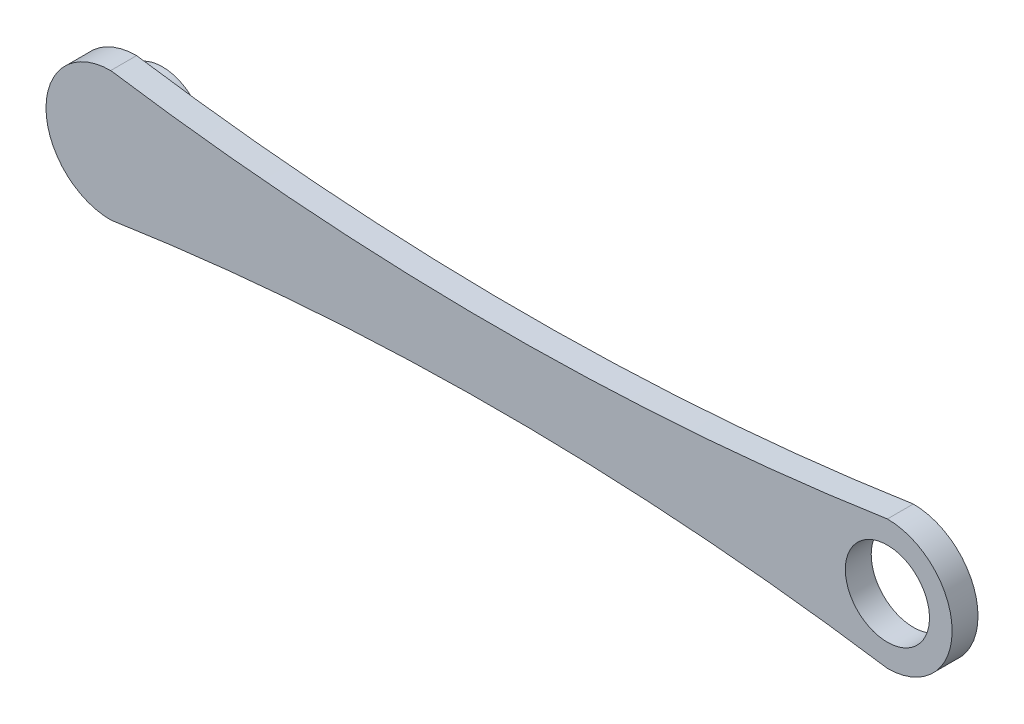
ISO-10303-21;
HEADER;
FILE_DESCRIPTION(('STEP AP214'),'2;1');
FILE_NAME('part.step','',(''),(''),'','','');
FILE_SCHEMA(('AUTOMOTIVE_DESIGN { 1 0 10303 214 1 1 1 1 }'));
ENDSEC;
DATA;
#1=APPLICATION_CONTEXT('core data for automotive mechanical design processes');
#2=APPLICATION_PROTOCOL_DEFINITION('international standard','automotive_design',2000,#1);
#3=PRODUCT_CONTEXT('',#1,'mechanical');
#4=PRODUCT('Part','Part','',(#3));
#5=PRODUCT_RELATED_PRODUCT_CATEGORY('part','',(#4));
#6=PRODUCT_DEFINITION_FORMATION('','',#4);
#7=PRODUCT_DEFINITION_CONTEXT('part definition',#1,'design');
#8=PRODUCT_DEFINITION('design','',#6,#7);
#9=PRODUCT_DEFINITION_SHAPE('','',#8);
#10=(LENGTH_UNIT() NAMED_UNIT(*) SI_UNIT(.MILLI.,.METRE.));
#11=(NAMED_UNIT(*) PLANE_ANGLE_UNIT() SI_UNIT($,.RADIAN.));
#12=(NAMED_UNIT(*) SI_UNIT($,.STERADIAN.) SOLID_ANGLE_UNIT());
#13=UNCERTAINTY_MEASURE_WITH_UNIT(LENGTH_MEASURE(1.E-05),#10,'distance_accuracy_value','');
#14=(GEOMETRIC_REPRESENTATION_CONTEXT(3) GLOBAL_UNCERTAINTY_ASSIGNED_CONTEXT((#13)) GLOBAL_UNIT_ASSIGNED_CONTEXT((#10,
#11,#12)) REPRESENTATION_CONTEXT('',''));
#15=CARTESIAN_POINT('',(0.,0.,0.));
#16=DIRECTION('',(0.,0.,1.));
#17=DIRECTION('',(1.,0.,0.));
#18=AXIS2_PLACEMENT_3D('',#15,#16,#17);
#19=CARTESIAN_POINT('',(1.76308690024151E-13,1013.68599666426,10.));
#20=DIRECTION('',(0.,0.,-1.));
#21=DIRECTION('',(-1.,0.,0.));
#22=AXIS2_PLACEMENT_3D('',#19,#20,#21);
#23=CYLINDRICAL_SURFACE('',#22,1000.);
#24=CARTESIAN_POINT('',(1.76308690024151E-13,1013.68599666426,0.));
#25=DIRECTION('',(0.,0.,-1.));
#26=DIRECTION('',(1.,0.,0.));
#27=AXIS2_PLACEMENT_3D('',#24,#25,#26);
#28=CIRCLE('',#27,1000.);
#29=CARTESIAN_POINT('',(150.,25.,0.));
#30=VERTEX_POINT('',#29);
#31=CARTESIAN_POINT('',(-150.,25.,0.));
#32=VERTEX_POINT('',#31);
#33=EDGE_CURVE('E99',#30,#32,#28,.T.);
#34=ORIENTED_EDGE('',*,*,#33,.T.);
#35=DIRECTION('',(0.,0.,-1.));
#36=VECTOR('',#35,1.);
#37=CARTESIAN_POINT('',(-150.,25.,10.));
#38=LINE('',#37,#36);
#39=CARTESIAN_POINT('',(-150.,25.,10.));
#40=VERTEX_POINT('',#39);
#41=EDGE_CURVE('E41',#40,#32,#38,.T.);
#42=ORIENTED_EDGE('',*,*,#41,.F.);
#43=CARTESIAN_POINT('',(1.76308690024151E-13,1013.68599666426,10.));
#44=DIRECTION('',(0.,0.,-1.));
#45=DIRECTION('',(1.,0.,0.));
#46=AXIS2_PLACEMENT_3D('',#43,#44,#45);
#47=CIRCLE('',#46,1000.);
#48=CARTESIAN_POINT('',(150.,25.,10.));
#49=VERTEX_POINT('',#48);
#50=EDGE_CURVE('E85',#49,#40,#47,.T.);
#51=ORIENTED_EDGE('',*,*,#50,.F.);
#52=DIRECTION('',(0.,0.,-1.));
#53=VECTOR('',#52,1.);
#54=CARTESIAN_POINT('',(150.,25.,10.));
#55=LINE('',#54,#53);
#56=EDGE_CURVE('E95',#49,#30,#55,.T.);
#57=ORIENTED_EDGE('',*,*,#56,.T.);
#58=EDGE_LOOP('',(#34,#42,#51,#57));
#59=FACE_BOUND('',#58,.T.);
#60=ADVANCED_FACE('F33',(#59),#23,.F.);
#61=CARTESIAN_POINT('',(-150.,0.,10.));
#62=DIRECTION('',(0.,0.,-1.));
#63=DIRECTION('',(-1.,0.,0.));
#64=AXIS2_PLACEMENT_3D('',#61,#62,#63);
#65=CYLINDRICAL_SURFACE('',#64,25.);
#66=CARTESIAN_POINT('',(-150.,0.,0.));
#67=DIRECTION('',(0.,0.,1.));
#68=DIRECTION('',(1.,0.,0.));
#69=AXIS2_PLACEMENT_3D('',#66,#67,#68);
#70=CIRCLE('',#69,25.);
#71=CARTESIAN_POINT('',(-150.,-25.0000000000001,0.));
#72=VERTEX_POINT('',#71);
#73=EDGE_CURVE('E90',#32,#72,#70,.T.);
#74=ORIENTED_EDGE('',*,*,#73,.T.);
#75=DIRECTION('',(0.,0.,-1.));
#76=VECTOR('',#75,1.);
#77=CARTESIAN_POINT('',(-150.,-25.0000000000001,10.));
#78=LINE('',#77,#76);
#79=CARTESIAN_POINT('',(-150.,-25.0000000000001,10.));
#80=VERTEX_POINT('',#79);
#81=EDGE_CURVE('E88',#80,#72,#78,.T.);
#82=ORIENTED_EDGE('',*,*,#81,.F.);
#83=CARTESIAN_POINT('',(-150.,0.,10.));
#84=DIRECTION('',(0.,0.,1.));
#85=DIRECTION('',(1.,0.,0.));
#86=AXIS2_PLACEMENT_3D('',#83,#84,#85);
#87=CIRCLE('',#86,25.);
#88=EDGE_CURVE('E80',#40,#80,#87,.T.);
#89=ORIENTED_EDGE('',*,*,#88,.F.);
#90=ORIENTED_EDGE('',*,*,#41,.T.);
#91=EDGE_LOOP('',(#74,#82,#89,#90));
#92=FACE_BOUND('',#91,.T.);
#93=ADVANCED_FACE('F89',(#92),#65,.T.);
#94=CARTESIAN_POINT('',(1.76308690024151E-13,-1013.68599666426,10.));
#95=DIRECTION('',(0.,0.,-1.));
#96=DIRECTION('',(-1.,0.,0.));
#97=AXIS2_PLACEMENT_3D('',#94,#95,#96);
#98=CYLINDRICAL_SURFACE('',#97,1000.);
#99=CARTESIAN_POINT('',(1.76308690024151E-13,-1013.68599666426,0.));
#100=DIRECTION('',(0.,0.,-1.));
#101=DIRECTION('',(-1.,0.,0.));
#102=AXIS2_PLACEMENT_3D('',#99,#100,#101);
#103=CIRCLE('',#102,1000.);
#104=CARTESIAN_POINT('',(150.,-25.,0.));
#105=VERTEX_POINT('',#104);
#106=EDGE_CURVE('E66',#72,#105,#103,.T.);
#107=ORIENTED_EDGE('',*,*,#106,.T.);
#108=DIRECTION('',(0.,0.,-1.));
#109=VECTOR('',#108,1.);
#110=CARTESIAN_POINT('',(150.,-25.,10.));
#111=LINE('',#110,#109);
#112=CARTESIAN_POINT('',(150.,-25.,10.));
#113=VERTEX_POINT('',#112);
#114=EDGE_CURVE('E91',#113,#105,#111,.T.);
#115=ORIENTED_EDGE('',*,*,#114,.F.);
#116=CARTESIAN_POINT('',(1.76308690024151E-13,-1013.68599666426,10.));
#117=DIRECTION('',(0.,0.,-1.));
#118=DIRECTION('',(-1.,0.,0.));
#119=AXIS2_PLACEMENT_3D('',#116,#117,#118);
#120=CIRCLE('',#119,1000.);
#121=EDGE_CURVE('E83',#80,#113,#120,.T.);
#122=ORIENTED_EDGE('',*,*,#121,.F.);
#123=ORIENTED_EDGE('',*,*,#81,.T.);
#124=EDGE_LOOP('',(#107,#115,#122,#123));
#125=FACE_BOUND('',#124,.T.);
#126=ADVANCED_FACE('F93',(#125),#98,.F.);
#127=CARTESIAN_POINT('',(150.,0.,10.));
#128=DIRECTION('',(0.,0.,-1.));
#129=DIRECTION('',(-1.,0.,0.));
#130=AXIS2_PLACEMENT_3D('',#127,#128,#129);
#131=CYLINDRICAL_SURFACE('',#130,25.);
#132=CARTESIAN_POINT('',(150.,0.,0.));
#133=DIRECTION('',(0.,0.,1.));
#134=DIRECTION('',(1.,0.,0.));
#135=AXIS2_PLACEMENT_3D('',#132,#133,#134);
#136=CIRCLE('',#135,25.);
#137=EDGE_CURVE('E72',#105,#30,#136,.T.);
#138=ORIENTED_EDGE('',*,*,#137,.T.);
#139=ORIENTED_EDGE('',*,*,#56,.F.);
#140=CARTESIAN_POINT('',(150.,0.,10.));
#141=DIRECTION('',(0.,0.,1.));
#142=DIRECTION('',(1.,0.,0.));
#143=AXIS2_PLACEMENT_3D('',#140,#141,#142);
#144=CIRCLE('',#143,25.);
#145=EDGE_CURVE('E49',#113,#49,#144,.T.);
#146=ORIENTED_EDGE('',*,*,#145,.F.);
#147=ORIENTED_EDGE('',*,*,#114,.T.);
#148=EDGE_LOOP('',(#138,#139,#146,#147));
#149=FACE_BOUND('',#148,.T.);
#150=ADVANCED_FACE('F122',(#149),#131,.T.);
#151=CARTESIAN_POINT('',(75.0000000000002,506.84299833213,10.));
#152=DIRECTION('',(0.,0.,1.));
#153=DIRECTION('',(1.,0.,0.));
#154=AXIS2_PLACEMENT_3D('',#151,#152,#153);
#155=PLANE('',#154);
#156=CARTESIAN_POINT('',(150.,0.,10.));
#157=DIRECTION('',(0.,0.,1.));
#158=DIRECTION('',(-1.,0.,0.));
#159=AXIS2_PLACEMENT_3D('',#156,#157,#158);
#160=CIRCLE('',#159,16.25);
#161=CARTESIAN_POINT('',(133.75,0.,10.));
#162=VERTEX_POINT('',#161);
#163=EDGE_CURVE('E182',#162,#162,#160,.T.);
#164=ORIENTED_EDGE('',*,*,#163,.F.);
#165=EDGE_LOOP('',(#164));
#166=FACE_BOUND('',#165,.T.);
#167=ORIENTED_EDGE('',*,*,#50,.T.);
#168=ORIENTED_EDGE('',*,*,#88,.T.);
#169=ORIENTED_EDGE('',*,*,#121,.T.);
#170=ORIENTED_EDGE('',*,*,#145,.T.);
#171=EDGE_LOOP('',(#167,#168,#169,#170));
#172=FACE_BOUND('',#171,.T.);
#173=ADVANCED_FACE('F81',(#166,#172),#155,.T.);
#174=CARTESIAN_POINT('',(75.0000000000002,506.84299833213,0.));
#175=DIRECTION('',(0.,0.,1.));
#176=DIRECTION('',(1.,0.,0.));
#177=AXIS2_PLACEMENT_3D('',#174,#175,#176);
#178=PLANE('',#177);
#179=CARTESIAN_POINT('',(150.,0.,0.));
#180=DIRECTION('',(0.,0.,1.));
#181=DIRECTION('',(-1.,0.,0.));
#182=AXIS2_PLACEMENT_3D('',#179,#180,#181);
#183=CIRCLE('',#182,16.25);
#184=CARTESIAN_POINT('',(133.75,0.,0.));
#185=VERTEX_POINT('',#184);
#186=EDGE_CURVE('E180',#185,#185,#183,.T.);
#187=ORIENTED_EDGE('',*,*,#186,.T.);
#188=EDGE_LOOP('',(#187));
#189=FACE_BOUND('',#188,.T.);
#190=CARTESIAN_POINT('',(-150.,0.,0.));
#191=DIRECTION('',(0.,0.,1.));
#192=DIRECTION('',(1.,0.,0.));
#193=AXIS2_PLACEMENT_3D('',#190,#191,#192);
#194=CIRCLE('',#193,16.25);
#195=CARTESIAN_POINT('',(-133.75,0.,0.));
#196=VERTEX_POINT('',#195);
#197=EDGE_CURVE('E11',#196,#196,#194,.F.);
#198=ORIENTED_EDGE('',*,*,#197,.F.);
#199=EDGE_LOOP('',(#198));
#200=FACE_BOUND('',#199,.T.);
#201=ORIENTED_EDGE('',*,*,#33,.F.);
#202=ORIENTED_EDGE('',*,*,#137,.F.);
#203=ORIENTED_EDGE('',*,*,#106,.F.);
#204=ORIENTED_EDGE('',*,*,#73,.F.);
#205=EDGE_LOOP('',(#201,#202,#203,#204));
#206=FACE_BOUND('',#205,.T.);
#207=ADVANCED_FACE('F110',(#189,#200,#206),#178,.F.);
#208=CARTESIAN_POINT('',(-150.,0.,-10.));
#209=DIRECTION('',(0.,0.,1.));
#210=DIRECTION('',(0.,-1.,0.));
#211=AXIS2_PLACEMENT_3D('',#208,#209,#210);
#212=CYLINDRICAL_SURFACE('',#211,16.25);
#213=CARTESIAN_POINT('',(-150.,0.,-10.));
#214=DIRECTION('',(0.,0.,-1.));
#215=DIRECTION('',(0.,1.,0.));
#216=AXIS2_PLACEMENT_3D('',#213,#214,#215);
#217=CIRCLE('',#216,16.25);
#218=CARTESIAN_POINT('',(-150.,16.25,-10.));
#219=VERTEX_POINT('',#218);
#220=EDGE_CURVE('E102',#219,#219,#217,.T.);
#221=ORIENTED_EDGE('',*,*,#220,.F.);
#222=EDGE_LOOP('',(#221));
#223=FACE_BOUND('',#222,.T.);
#224=ORIENTED_EDGE('',*,*,#197,.T.);
#225=EDGE_LOOP('',(#224));
#226=FACE_BOUND('',#225,.T.);
#227=ADVANCED_FACE('F112',(#223,#226),#212,.T.);
#228=CARTESIAN_POINT('',(-150.,0.,-10.));
#229=DIRECTION('',(0.,0.,-1.));
#230=DIRECTION('',(0.,1.,0.));
#231=AXIS2_PLACEMENT_3D('',#228,#229,#230);
#232=PLANE('',#231);
#233=ORIENTED_EDGE('',*,*,#220,.T.);
#234=EDGE_LOOP('',(#233));
#235=FACE_BOUND('',#234,.T.);
#236=ADVANCED_FACE('F119',(#235),#232,.T.);
#237=CARTESIAN_POINT('',(150.,0.,0.));
#238=DIRECTION('',(0.,0.,1.));
#239=DIRECTION('',(1.,0.,0.));
#240=AXIS2_PLACEMENT_3D('',#237,#238,#239);
#241=CYLINDRICAL_SURFACE('',#240,16.25);
#242=ORIENTED_EDGE('',*,*,#186,.F.);
#243=EDGE_LOOP('',(#242));
#244=FACE_BOUND('',#243,.T.);
#245=ORIENTED_EDGE('',*,*,#163,.T.);
#246=EDGE_LOOP('',(#245));
#247=FACE_BOUND('',#246,.T.);
#248=ADVANCED_FACE('F160',(#244,#247),#241,.F.);
#249=CLOSED_SHELL('',(#60,#93,#126,#150,#173,#207,#227,#236,#248));
#250=MANIFOLD_SOLID_BREP('B2',#249);
#251=ADVANCED_BREP_SHAPE_REPRESENTATION('',(#18,#250),#14);
#252=SHAPE_DEFINITION_REPRESENTATION(#9,#251);
ENDSEC;
END-ISO-10303-21;
